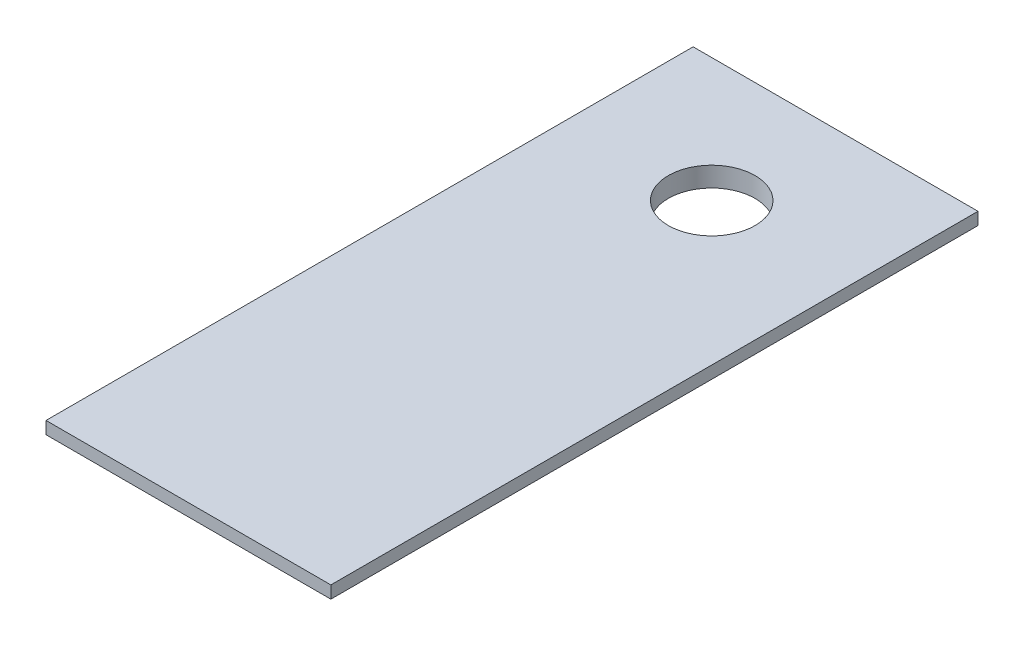
ISO-10303-21;
HEADER;
FILE_DESCRIPTION(('STEP AP214'),'2;1');
FILE_NAME('part.step','',(''),(''),'','','');
FILE_SCHEMA(('AUTOMOTIVE_DESIGN { 1 0 10303 214 1 1 1 1 }'));
ENDSEC;
DATA;
#1=APPLICATION_CONTEXT('core data for automotive mechanical design processes');
#2=APPLICATION_PROTOCOL_DEFINITION('international standard','automotive_design',2000,#1);
#3=PRODUCT_CONTEXT('',#1,'mechanical');
#4=PRODUCT('Part','Part','',(#3));
#5=PRODUCT_RELATED_PRODUCT_CATEGORY('part','',(#4));
#6=PRODUCT_DEFINITION_FORMATION('','',#4);
#7=PRODUCT_DEFINITION_CONTEXT('part definition',#1,'design');
#8=PRODUCT_DEFINITION('design','',#6,#7);
#9=PRODUCT_DEFINITION_SHAPE('','',#8);
#10=(LENGTH_UNIT() NAMED_UNIT(*) SI_UNIT(.MILLI.,.METRE.));
#11=(NAMED_UNIT(*) PLANE_ANGLE_UNIT() SI_UNIT($,.RADIAN.));
#12=(NAMED_UNIT(*) SI_UNIT($,.STERADIAN.) SOLID_ANGLE_UNIT());
#13=UNCERTAINTY_MEASURE_WITH_UNIT(LENGTH_MEASURE(1.E-05),#10,'distance_accuracy_value','');
#14=(GEOMETRIC_REPRESENTATION_CONTEXT(3) GLOBAL_UNCERTAINTY_ASSIGNED_CONTEXT((#13)) GLOBAL_UNIT_ASSIGNED_CONTEXT((#10,
#11,#12)) REPRESENTATION_CONTEXT('',''));
#15=CARTESIAN_POINT('',(0.,0.,0.));
#16=DIRECTION('',(0.,0.,1.));
#17=DIRECTION('',(1.,0.,0.));
#18=AXIS2_PLACEMENT_3D('',#15,#16,#17);
#19=CARTESIAN_POINT('',(0.,6.9,-50.));
#20=DIRECTION('',(-1.,0.,0.));
#21=DIRECTION('',(0.,0.,1.));
#22=AXIS2_PLACEMENT_3D('',#19,#20,#21);
#23=PLANE('',#22);
#24=DIRECTION('',(0.,0.,1.));
#25=VECTOR('',#24,1.);
#26=CARTESIAN_POINT('',(0.,7.5,-50.));
#27=LINE('',#26,#25);
#28=CARTESIAN_POINT('',(0.,7.5,-50.));
#29=VERTEX_POINT('',#28);
#30=CARTESIAN_POINT('',(0.,7.5,-0.75));
#31=VERTEX_POINT('',#30);
#32=EDGE_CURVE('E138',#29,#31,#27,.T.);
#33=ORIENTED_EDGE('',*,*,#32,.F.);
#34=DIRECTION('',(0.,1.,0.));
#35=VECTOR('',#34,1.);
#36=CARTESIAN_POINT('',(0.,6.9,-50.));
#37=LINE('',#36,#35);
#38=CARTESIAN_POINT('',(0.,6.9,-50.));
#39=VERTEX_POINT('',#38);
#40=EDGE_CURVE('E11',#39,#29,#37,.T.);
#41=ORIENTED_EDGE('',*,*,#40,.F.);
#42=DIRECTION('',(0.,0.,1.));
#43=VECTOR('',#42,1.);
#44=CARTESIAN_POINT('',(0.,6.9,-50.));
#45=LINE('',#44,#43);
#46=CARTESIAN_POINT('',(0.,6.9,-0.75));
#47=VERTEX_POINT('',#46);
#48=EDGE_CURVE('E149',#39,#47,#45,.T.);
#49=ORIENTED_EDGE('',*,*,#48,.T.);
#50=DIRECTION('',(0.,1.,0.));
#51=VECTOR('',#50,1.);
#52=CARTESIAN_POINT('',(0.,6.9,-0.75));
#53=LINE('',#52,#51);
#54=EDGE_CURVE('E42',#47,#31,#53,.T.);
#55=ORIENTED_EDGE('',*,*,#54,.T.);
#56=EDGE_LOOP('',(#33,#41,#49,#55));
#57=FACE_BOUND('',#56,.T.);
#58=ADVANCED_FACE('F39',(#57),#23,.T.);
#59=CARTESIAN_POINT('',(0.,6.9,-50.));
#60=DIRECTION('',(0.,0.,-1.));
#61=DIRECTION('',(-1.,0.,0.));
#62=AXIS2_PLACEMENT_3D('',#59,#60,#61);
#63=PLANE('',#62);
#64=DIRECTION('',(-1.,0.,0.));
#65=VECTOR('',#64,1.);
#66=CARTESIAN_POINT('',(0.,7.5,-50.));
#67=LINE('',#66,#65);
#68=CARTESIAN_POINT('',(20.,7.5,-50.));
#69=VERTEX_POINT('',#68);
#70=EDGE_CURVE('E153',#69,#29,#67,.T.);
#71=ORIENTED_EDGE('',*,*,#70,.F.);
#72=DIRECTION('',(0.,1.,0.));
#73=VECTOR('',#72,1.);
#74=CARTESIAN_POINT('',(20.,6.9,-50.));
#75=LINE('',#74,#73);
#76=CARTESIAN_POINT('',(20.,6.9,-50.));
#77=VERTEX_POINT('',#76);
#78=EDGE_CURVE('E49',#77,#69,#75,.T.);
#79=ORIENTED_EDGE('',*,*,#78,.F.);
#80=DIRECTION('',(-1.,0.,0.));
#81=VECTOR('',#80,1.);
#82=CARTESIAN_POINT('',(0.,6.9,-50.));
#83=LINE('',#82,#81);
#84=EDGE_CURVE('E159',#77,#39,#83,.T.);
#85=ORIENTED_EDGE('',*,*,#84,.T.);
#86=ORIENTED_EDGE('',*,*,#40,.T.);
#87=EDGE_LOOP('',(#71,#79,#85,#86));
#88=FACE_BOUND('',#87,.T.);
#89=ADVANCED_FACE('F180',(#88),#63,.T.);
#90=CARTESIAN_POINT('',(20.,6.9,-50.));
#91=DIRECTION('',(1.,0.,0.));
#92=DIRECTION('',(0.,0.,-1.));
#93=AXIS2_PLACEMENT_3D('',#90,#91,#92);
#94=PLANE('',#93);
#95=DIRECTION('',(0.,0.,-1.));
#96=VECTOR('',#95,1.);
#97=CARTESIAN_POINT('',(20.,7.5,-50.));
#98=LINE('',#97,#96);
#99=CARTESIAN_POINT('',(20.,7.5,-0.75));
#100=VERTEX_POINT('',#99);
#101=EDGE_CURVE('E166',#100,#69,#98,.T.);
#102=ORIENTED_EDGE('',*,*,#101,.F.);
#103=DIRECTION('',(0.,1.,0.));
#104=VECTOR('',#103,1.);
#105=CARTESIAN_POINT('',(20.,6.9,-0.75));
#106=LINE('',#105,#104);
#107=CARTESIAN_POINT('',(20.,6.9,-0.75));
#108=VERTEX_POINT('',#107);
#109=EDGE_CURVE('E72',#108,#100,#106,.T.);
#110=ORIENTED_EDGE('',*,*,#109,.F.);
#111=DIRECTION('',(0.,0.,-1.));
#112=VECTOR('',#111,1.);
#113=CARTESIAN_POINT('',(20.,6.9,-50.));
#114=LINE('',#113,#112);
#115=EDGE_CURVE('E156',#108,#77,#114,.T.);
#116=ORIENTED_EDGE('',*,*,#115,.T.);
#117=ORIENTED_EDGE('',*,*,#78,.T.);
#118=EDGE_LOOP('',(#102,#110,#116,#117));
#119=FACE_BOUND('',#118,.T.);
#120=ADVANCED_FACE('F185',(#119),#94,.T.);
#121=CARTESIAN_POINT('',(0.,6.9,-0.75));
#122=DIRECTION('',(0.,0.,1.));
#123=DIRECTION('',(1.,0.,0.));
#124=AXIS2_PLACEMENT_3D('',#121,#122,#123);
#125=PLANE('',#124);
#126=DIRECTION('',(1.,0.,0.));
#127=VECTOR('',#126,1.);
#128=CARTESIAN_POINT('',(0.,7.5,-0.75));
#129=LINE('',#128,#127);
#130=EDGE_CURVE('E143',#31,#100,#129,.T.);
#131=ORIENTED_EDGE('',*,*,#130,.F.);
#132=ORIENTED_EDGE('',*,*,#54,.F.);
#133=DIRECTION('',(1.,0.,0.));
#134=VECTOR('',#133,1.);
#135=CARTESIAN_POINT('',(0.,6.9,-0.75));
#136=LINE('',#135,#134);
#137=EDGE_CURVE('E152',#47,#108,#136,.T.);
#138=ORIENTED_EDGE('',*,*,#137,.T.);
#139=ORIENTED_EDGE('',*,*,#109,.T.);
#140=EDGE_LOOP('',(#131,#132,#138,#139));
#141=FACE_BOUND('',#140,.T.);
#142=ADVANCED_FACE('F176',(#141),#125,.T.);
#143=CARTESIAN_POINT('',(0.,6.9,0.));
#144=DIRECTION('',(0.,1.,0.));
#145=DIRECTION('',(0.,0.,1.));
#146=AXIS2_PLACEMENT_3D('',#143,#144,#145);
#147=PLANE('',#146);
#148=CARTESIAN_POINT('',(10.,6.9,-41.5));
#149=DIRECTION('',(0.,1.,0.));
#150=DIRECTION('',(0.,0.,1.));
#151=AXIS2_PLACEMENT_3D('',#148,#149,#150);
#152=CIRCLE('',#151,3.5);
#153=CARTESIAN_POINT('',(10.,6.9,-38.));
#154=VERTEX_POINT('',#153);
#155=EDGE_CURVE('E283',#154,#154,#152,.T.);
#156=ORIENTED_EDGE('',*,*,#155,.T.);
#157=EDGE_LOOP('',(#156));
#158=FACE_BOUND('',#157,.T.);
#159=ORIENTED_EDGE('',*,*,#48,.F.);
#160=ORIENTED_EDGE('',*,*,#84,.F.);
#161=ORIENTED_EDGE('',*,*,#115,.F.);
#162=ORIENTED_EDGE('',*,*,#137,.F.);
#163=EDGE_LOOP('',(#159,#160,#161,#162));
#164=FACE_BOUND('',#163,.T.);
#165=ADVANCED_FACE('F184',(#158,#164),#147,.F.);
#166=CARTESIAN_POINT('',(0.,7.5,0.));
#167=DIRECTION('',(0.,1.,0.));
#168=DIRECTION('',(0.,0.,1.));
#169=AXIS2_PLACEMENT_3D('',#166,#167,#168);
#170=PLANE('',#169);
#171=DIRECTION('',(0.,0.,1.));
#172=VECTOR('',#171,1.);
#173=CARTESIAN_POINT('',(-1.5,7.5,-51.5));
#174=LINE('',#173,#172);
#175=CARTESIAN_POINT('',(-1.5,7.5,-51.5));
#176=VERTEX_POINT('',#175);
#177=CARTESIAN_POINT('',(-1.5,7.5,0.75));
#178=VERTEX_POINT('',#177);
#179=EDGE_CURVE('E136',#176,#178,#174,.T.);
#180=ORIENTED_EDGE('',*,*,#179,.F.);
#181=DIRECTION('',(-1.,0.,0.));
#182=VECTOR('',#181,1.);
#183=CARTESIAN_POINT('',(-1.5,7.5,-51.5));
#184=LINE('',#183,#182);
#185=CARTESIAN_POINT('',(21.5,7.5,-51.5));
#186=VERTEX_POINT('',#185);
#187=EDGE_CURVE('E132',#186,#176,#184,.T.);
#188=ORIENTED_EDGE('',*,*,#187,.F.);
#189=DIRECTION('',(0.,0.,-1.));
#190=VECTOR('',#189,1.);
#191=CARTESIAN_POINT('',(21.5,7.5,-51.5));
#192=LINE('',#191,#190);
#193=CARTESIAN_POINT('',(21.5,7.5,0.75));
#194=VERTEX_POINT('',#193);
#195=EDGE_CURVE('E299',#194,#186,#192,.T.);
#196=ORIENTED_EDGE('',*,*,#195,.F.);
#197=DIRECTION('',(1.,0.,0.));
#198=VECTOR('',#197,1.);
#199=CARTESIAN_POINT('',(-1.5,7.5,0.75));
#200=LINE('',#199,#198);
#201=EDGE_CURVE('E288',#178,#194,#200,.T.);
#202=ORIENTED_EDGE('',*,*,#201,.F.);
#203=EDGE_LOOP('',(#180,#188,#196,#202));
#204=FACE_BOUND('',#203,.T.);
#205=ORIENTED_EDGE('',*,*,#70,.T.);
#206=ORIENTED_EDGE('',*,*,#32,.T.);
#207=ORIENTED_EDGE('',*,*,#130,.T.);
#208=ORIENTED_EDGE('',*,*,#101,.T.);
#209=EDGE_LOOP('',(#205,#206,#207,#208));
#210=FACE_BOUND('',#209,.T.);
#211=ADVANCED_FACE('F178',(#204,#210),#170,.F.);
#212=CARTESIAN_POINT('',(-1.5,8.5,-51.5));
#213=DIRECTION('',(1.,0.,0.));
#214=DIRECTION('',(0.,0.,-1.));
#215=AXIS2_PLACEMENT_3D('',#212,#213,#214);
#216=PLANE('',#215);
#217=ORIENTED_EDGE('',*,*,#179,.T.);
#218=DIRECTION('',(0.,-1.,0.));
#219=VECTOR('',#218,1.);
#220=CARTESIAN_POINT('',(-1.5,8.5,0.75));
#221=LINE('',#220,#219);
#222=CARTESIAN_POINT('',(-1.5,8.5,0.75));
#223=VERTEX_POINT('',#222);
#224=EDGE_CURVE('E114',#223,#178,#221,.T.);
#225=ORIENTED_EDGE('',*,*,#224,.F.);
#226=DIRECTION('',(0.,0.,1.));
#227=VECTOR('',#226,1.);
#228=CARTESIAN_POINT('',(-1.5,8.5,-51.5));
#229=LINE('',#228,#227);
#230=CARTESIAN_POINT('',(-1.5,8.5,-51.5));
#231=VERTEX_POINT('',#230);
#232=EDGE_CURVE('E122',#231,#223,#229,.T.);
#233=ORIENTED_EDGE('',*,*,#232,.F.);
#234=DIRECTION('',(0.,-1.,0.));
#235=VECTOR('',#234,1.);
#236=CARTESIAN_POINT('',(-1.5,8.5,-51.5));
#237=LINE('',#236,#235);
#238=EDGE_CURVE('E295',#231,#176,#237,.T.);
#239=ORIENTED_EDGE('',*,*,#238,.T.);
#240=EDGE_LOOP('',(#217,#225,#233,#239));
#241=FACE_BOUND('',#240,.T.);
#242=ADVANCED_FACE('F134',(#241),#216,.F.);
#243=CARTESIAN_POINT('',(-1.5,8.5,0.75));
#244=DIRECTION('',(0.,0.,-1.));
#245=DIRECTION('',(-1.,0.,0.));
#246=AXIS2_PLACEMENT_3D('',#243,#244,#245);
#247=PLANE('',#246);
#248=ORIENTED_EDGE('',*,*,#201,.T.);
#249=DIRECTION('',(0.,-1.,0.));
#250=VECTOR('',#249,1.);
#251=CARTESIAN_POINT('',(21.5,8.5,0.75));
#252=LINE('',#251,#250);
#253=CARTESIAN_POINT('',(21.5,8.5,0.75));
#254=VERTEX_POINT('',#253);
#255=EDGE_CURVE('E117',#254,#194,#252,.T.);
#256=ORIENTED_EDGE('',*,*,#255,.F.);
#257=DIRECTION('',(1.,0.,0.));
#258=VECTOR('',#257,1.);
#259=CARTESIAN_POINT('',(-1.5,8.5,0.75));
#260=LINE('',#259,#258);
#261=EDGE_CURVE('E110',#223,#254,#260,.T.);
#262=ORIENTED_EDGE('',*,*,#261,.F.);
#263=ORIENTED_EDGE('',*,*,#224,.T.);
#264=EDGE_LOOP('',(#248,#256,#262,#263));
#265=FACE_BOUND('',#264,.T.);
#266=ADVANCED_FACE('F112',(#265),#247,.F.);
#267=CARTESIAN_POINT('',(21.5,8.5,-51.5));
#268=DIRECTION('',(-1.,0.,0.));
#269=DIRECTION('',(0.,0.,1.));
#270=AXIS2_PLACEMENT_3D('',#267,#268,#269);
#271=PLANE('',#270);
#272=ORIENTED_EDGE('',*,*,#195,.T.);
#273=DIRECTION('',(0.,-1.,0.));
#274=VECTOR('',#273,1.);
#275=CARTESIAN_POINT('',(21.5,8.5,-51.5));
#276=LINE('',#275,#274);
#277=CARTESIAN_POINT('',(21.5,8.5,-51.5));
#278=VERTEX_POINT('',#277);
#279=EDGE_CURVE('E145',#278,#186,#276,.T.);
#280=ORIENTED_EDGE('',*,*,#279,.F.);
#281=DIRECTION('',(0.,0.,-1.));
#282=VECTOR('',#281,1.);
#283=CARTESIAN_POINT('',(21.5,8.5,-51.5));
#284=LINE('',#283,#282);
#285=EDGE_CURVE('E121',#254,#278,#284,.T.);
#286=ORIENTED_EDGE('',*,*,#285,.F.);
#287=ORIENTED_EDGE('',*,*,#255,.T.);
#288=EDGE_LOOP('',(#272,#280,#286,#287));
#289=FACE_BOUND('',#288,.T.);
#290=ADVANCED_FACE('F242',(#289),#271,.F.);
#291=CARTESIAN_POINT('',(-1.5,8.5,-51.5));
#292=DIRECTION('',(0.,0.,1.));
#293=DIRECTION('',(1.,0.,0.));
#294=AXIS2_PLACEMENT_3D('',#291,#292,#293);
#295=PLANE('',#294);
#296=ORIENTED_EDGE('',*,*,#187,.T.);
#297=ORIENTED_EDGE('',*,*,#238,.F.);
#298=DIRECTION('',(-1.,0.,0.));
#299=VECTOR('',#298,1.);
#300=CARTESIAN_POINT('',(-1.5,8.5,-51.5));
#301=LINE('',#300,#299);
#302=EDGE_CURVE('E127',#278,#231,#301,.T.);
#303=ORIENTED_EDGE('',*,*,#302,.F.);
#304=ORIENTED_EDGE('',*,*,#279,.T.);
#305=EDGE_LOOP('',(#296,#297,#303,#304));
#306=FACE_BOUND('',#305,.T.);
#307=ADVANCED_FACE('F249',(#306),#295,.F.);
#308=CARTESIAN_POINT('',(0.,8.5,0.));
#309=DIRECTION('',(0.,1.,0.));
#310=DIRECTION('',(0.,0.,1.));
#311=AXIS2_PLACEMENT_3D('',#308,#309,#310);
#312=PLANE('',#311);
#313=CARTESIAN_POINT('',(10.,8.5,-41.5));
#314=DIRECTION('',(0.,1.,0.));
#315=DIRECTION('',(0.,0.,1.));
#316=AXIS2_PLACEMENT_3D('',#313,#314,#315);
#317=CIRCLE('',#316,3.5);
#318=CARTESIAN_POINT('',(10.,8.5,-38.));
#319=VERTEX_POINT('',#318);
#320=EDGE_CURVE('E280',#319,#319,#317,.T.);
#321=ORIENTED_EDGE('',*,*,#320,.F.);
#322=EDGE_LOOP('',(#321));
#323=FACE_BOUND('',#322,.T.);
#324=ORIENTED_EDGE('',*,*,#232,.T.);
#325=ORIENTED_EDGE('',*,*,#261,.T.);
#326=ORIENTED_EDGE('',*,*,#285,.T.);
#327=ORIENTED_EDGE('',*,*,#302,.T.);
#328=EDGE_LOOP('',(#324,#325,#326,#327));
#329=FACE_BOUND('',#328,.T.);
#330=ADVANCED_FACE('F125',(#323,#329),#312,.T.);
#331=CARTESIAN_POINT('',(10.,-1.5,-41.5));
#332=DIRECTION('',(0.,1.,0.));
#333=DIRECTION('',(0.,0.,1.));
#334=AXIS2_PLACEMENT_3D('',#331,#332,#333);
#335=CYLINDRICAL_SURFACE('',#334,3.5);
#336=ORIENTED_EDGE('',*,*,#320,.T.);
#337=EDGE_LOOP('',(#336));
#338=FACE_BOUND('',#337,.T.);
#339=ORIENTED_EDGE('',*,*,#155,.F.);
#340=EDGE_LOOP('',(#339));
#341=FACE_BOUND('',#340,.T.);
#342=ADVANCED_FACE('F263',(#338,#341),#335,.F.);
#343=CLOSED_SHELL('',(#58,#89,#120,#142,#165,#211,#242,#266,#290,#307,#330,#342));
#344=MANIFOLD_SOLID_BREP('B2',#343);
#345=ADVANCED_BREP_SHAPE_REPRESENTATION('',(#18,#344),#14);
#346=SHAPE_DEFINITION_REPRESENTATION(#9,#345);
ENDSEC;
END-ISO-10303-21;
